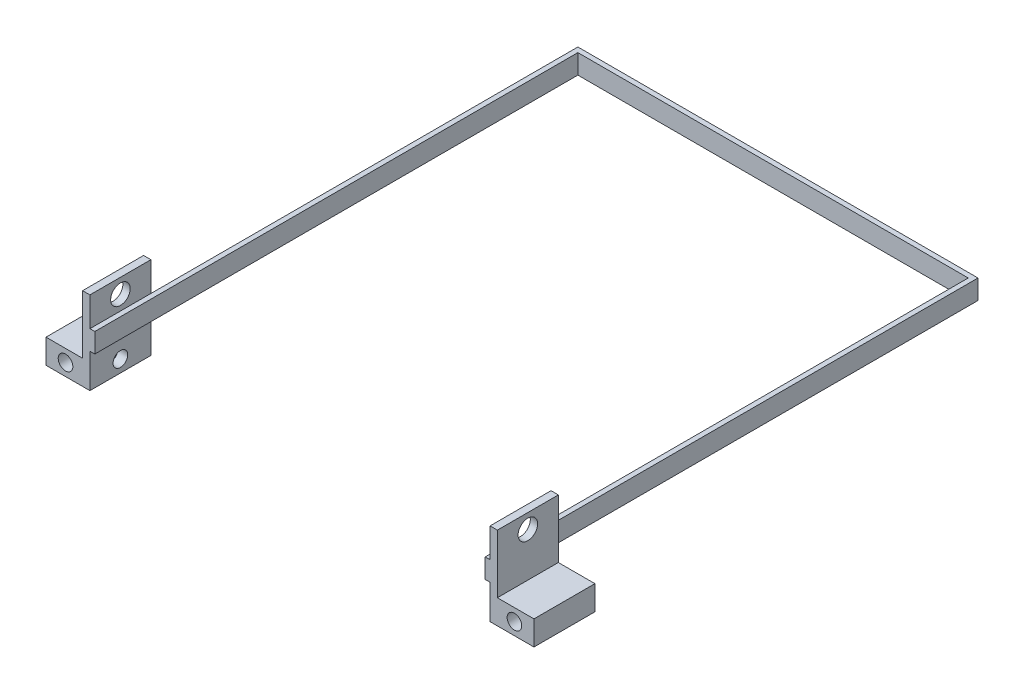
ISO-10303-21;
HEADER;
FILE_DESCRIPTION(('STEP AP214'),'2;1');
FILE_NAME('part.step','',(''),(''),'','','');
FILE_SCHEMA(('AUTOMOTIVE_DESIGN { 1 0 10303 214 1 1 1 1 }'));
ENDSEC;
DATA;
#1=APPLICATION_CONTEXT('core data for automotive mechanical design processes');
#2=APPLICATION_PROTOCOL_DEFINITION('international standard','automotive_design',2000,#1);
#3=PRODUCT_CONTEXT('',#1,'mechanical');
#4=PRODUCT('Part','Part','',(#3));
#5=PRODUCT_RELATED_PRODUCT_CATEGORY('part','',(#4));
#6=PRODUCT_DEFINITION_FORMATION('','',#4);
#7=PRODUCT_DEFINITION_CONTEXT('part definition',#1,'design');
#8=PRODUCT_DEFINITION('design','',#6,#7);
#9=PRODUCT_DEFINITION_SHAPE('','',#8);
#10=(LENGTH_UNIT() NAMED_UNIT(*) SI_UNIT(.MILLI.,.METRE.));
#11=(NAMED_UNIT(*) PLANE_ANGLE_UNIT() SI_UNIT($,.RADIAN.));
#12=(NAMED_UNIT(*) SI_UNIT($,.STERADIAN.) SOLID_ANGLE_UNIT());
#13=UNCERTAINTY_MEASURE_WITH_UNIT(LENGTH_MEASURE(1.E-05),#10,'distance_accuracy_value','');
#14=(GEOMETRIC_REPRESENTATION_CONTEXT(3) GLOBAL_UNCERTAINTY_ASSIGNED_CONTEXT((#13)) GLOBAL_UNIT_ASSIGNED_CONTEXT((#10,
#11,#12)) REPRESENTATION_CONTEXT('',''));
#15=CARTESIAN_POINT('',(0.,0.,0.));
#16=DIRECTION('',(0.,0.,1.));
#17=DIRECTION('',(1.,0.,0.));
#18=AXIS2_PLACEMENT_3D('',#15,#16,#17);
#19=CARTESIAN_POINT('',(150.362843907959,0.561265164644706,-199.999999999999));
#20=DIRECTION('',(-1.,0.,0.));
#21=DIRECTION('',(0.,1.,0.));
#22=AXIS2_PLACEMENT_3D('',#19,#20,#21);
#23=PLANE('',#22);
#24=DIRECTION('',(0.,1.,0.));
#25=VECTOR('',#24,1.);
#26=CARTESIAN_POINT('',(150.362843907958,12.5612651646447,-24.9999999999989));
#27=LINE('',#26,#25);
#28=CARTESIAN_POINT('',(150.362843907958,-7.43873483535529,-24.9999999999989));
#29=VERTEX_POINT('',#28);
#30=CARTESIAN_POINT('',(150.362843907958,0.561265164644706,-24.9999999999989));
#31=VERTEX_POINT('',#30);
#32=EDGE_CURVE('E11',#29,#31,#27,.T.);
#33=ORIENTED_EDGE('',*,*,#32,.F.);
#34=DIRECTION('',(0.,0.,1.));
#35=VECTOR('',#34,1.);
#36=CARTESIAN_POINT('',(150.362843907959,-7.43873483535529,-199.999999999999));
#37=LINE('',#36,#35);
#38=CARTESIAN_POINT('',(150.362843907959,-7.43873483535529,-199.999999999999));
#39=VERTEX_POINT('',#38);
#40=EDGE_CURVE('E44',#39,#29,#37,.T.);
#41=ORIENTED_EDGE('',*,*,#40,.F.);
#42=DIRECTION('',(0.,-1.,0.));
#43=VECTOR('',#42,1.);
#44=CARTESIAN_POINT('',(150.362843907959,0.561265164644706,-199.999999999999));
#45=LINE('',#44,#43);
#46=CARTESIAN_POINT('',(150.362843907959,0.561265164644706,-199.999999999999));
#47=VERTEX_POINT('',#46);
#48=EDGE_CURVE('E341',#47,#39,#45,.T.);
#49=ORIENTED_EDGE('',*,*,#48,.F.);
#50=DIRECTION('',(0.,0.,1.));
#51=VECTOR('',#50,1.);
#52=CARTESIAN_POINT('',(150.362843907959,0.561265164644706,-199.999999999999));
#53=LINE('',#52,#51);
#54=EDGE_CURVE('E358',#47,#31,#53,.T.);
#55=ORIENTED_EDGE('',*,*,#54,.T.);
#56=EDGE_LOOP('',(#33,#41,#49,#55));
#57=FACE_BOUND('',#56,.T.);
#58=ADVANCED_FACE('F41',(#57),#23,.F.);
#59=CARTESIAN_POINT('',(150.362843907959,-7.43873483535529,-199.999999999999));
#60=DIRECTION('',(0.,1.,0.));
#61=DIRECTION('',(0.,0.,-1.));
#62=AXIS2_PLACEMENT_3D('',#59,#60,#61);
#63=PLANE('',#62);
#64=DIRECTION('',(0.,0.,1.));
#65=VECTOR('',#64,1.);
#66=CARTESIAN_POINT('',(148.362843907959,-7.43873483535529,-197.999999999999));
#67=LINE('',#66,#65);
#68=CARTESIAN_POINT('',(148.362843907959,-7.43873483535529,-197.999999999999));
#69=VERTEX_POINT('',#68);
#70=CARTESIAN_POINT('',(148.362843907958,-7.43873483535529,1.03993149546166E-12));
#71=VERTEX_POINT('',#70);
#72=EDGE_CURVE('E338',#69,#71,#67,.T.);
#73=ORIENTED_EDGE('',*,*,#72,.F.);
#74=DIRECTION('',(-1.,0.,0.));
#75=VECTOR('',#74,1.);
#76=CARTESIAN_POINT('',(148.362843907959,-7.43873483535529,-197.999999999999));
#77=LINE('',#76,#75);
#78=CARTESIAN_POINT('',(-11.6371560920411,-7.43873483535529,-198.));
#79=VERTEX_POINT('',#78);
#80=EDGE_CURVE('E318',#69,#79,#77,.T.);
#81=ORIENTED_EDGE('',*,*,#80,.T.);
#82=DIRECTION('',(0.,0.,1.));
#83=VECTOR('',#82,1.);
#84=CARTESIAN_POINT('',(-11.6371560920411,-7.43873483535529,-198.));
#85=LINE('',#84,#83);
#86=CARTESIAN_POINT('',(-11.6371560920425,-7.43873483535529,0.));
#87=VERTEX_POINT('',#86);
#88=EDGE_CURVE('E335',#79,#87,#85,.T.);
#89=ORIENTED_EDGE('',*,*,#88,.T.);
#90=DIRECTION('',(-1.,0.,0.));
#91=VECTOR('',#90,1.);
#92=CARTESIAN_POINT('',(150.362843907958,-7.43873483535529,1.05389742081703E-12));
#93=LINE('',#92,#91);
#94=CARTESIAN_POINT('',(-13.6371560920423,-7.43873483535529,4.92661467177413E-13));
#95=VERTEX_POINT('',#94);
#96=EDGE_CURVE('E340',#87,#95,#93,.T.);
#97=ORIENTED_EDGE('',*,*,#96,.T.);
#98=DIRECTION('',(0.,0.,1.));
#99=VECTOR('',#98,1.);
#100=CARTESIAN_POINT('',(-13.6371560920411,-7.43873483535529,-200.));
#101=LINE('',#100,#99);
#102=CARTESIAN_POINT('',(-13.6371560920423,-7.43873483535529,-24.9999999999995));
#103=VERTEX_POINT('',#102);
#104=EDGE_CURVE('E363',#103,#95,#101,.T.);
#105=ORIENTED_EDGE('',*,*,#104,.F.);
#106=CARTESIAN_POINT('',(-13.6371560920411,-7.43873483535529,-200.));
#107=VERTEX_POINT('',#106);
#108=EDGE_CURVE('E364',#107,#103,#101,.T.);
#109=ORIENTED_EDGE('',*,*,#108,.F.);
#110=DIRECTION('',(-1.,0.,0.));
#111=VECTOR('',#110,1.);
#112=CARTESIAN_POINT('',(150.362843907959,-7.43873483535529,-199.999999999999));
#113=LINE('',#112,#111);
#114=EDGE_CURVE('E344',#39,#107,#113,.T.);
#115=ORIENTED_EDGE('',*,*,#114,.F.);
#116=ORIENTED_EDGE('',*,*,#40,.T.);
#117=CARTESIAN_POINT('',(150.362843907958,-7.43873483535529,1.05389742081703E-12));
#118=VERTEX_POINT('',#117);
#119=EDGE_CURVE('E366',#29,#118,#37,.T.);
#120=ORIENTED_EDGE('',*,*,#119,.T.);
#121=EDGE_CURVE('E352',#118,#71,#93,.T.);
#122=ORIENTED_EDGE('',*,*,#121,.T.);
#123=EDGE_LOOP('',(#73,#81,#89,#97,#105,#109,#115,#116,#120,#122));
#124=FACE_BOUND('',#123,.T.);
#125=ADVANCED_FACE('F385',(#124),#63,.F.);
#126=CARTESIAN_POINT('',(150.362843907959,0.561265164644706,-199.999999999999));
#127=DIRECTION('',(0.,-1.,0.));
#128=DIRECTION('',(0.,0.,1.));
#129=AXIS2_PLACEMENT_3D('',#126,#127,#128);
#130=PLANE('',#129);
#131=DIRECTION('',(0.,0.,1.));
#132=VECTOR('',#131,1.);
#133=CARTESIAN_POINT('',(148.362843907959,0.561265164644706,-197.999999999999));
#134=LINE('',#133,#132);
#135=CARTESIAN_POINT('',(148.362843907959,0.561265164644706,-197.999999999999));
#136=VERTEX_POINT('',#135);
#137=CARTESIAN_POINT('',(148.362843907958,0.561265164644706,1.03993149546166E-12));
#138=VERTEX_POINT('',#137);
#139=EDGE_CURVE('E327',#136,#138,#134,.T.);
#140=ORIENTED_EDGE('',*,*,#139,.T.);
#141=DIRECTION('',(1.,0.,0.));
#142=VECTOR('',#141,1.);
#143=CARTESIAN_POINT('',(150.362843907958,0.561265164644706,1.05389742081703E-12));
#144=LINE('',#143,#142);
#145=CARTESIAN_POINT('',(150.362843907958,0.561265164644706,1.05389742081703E-12));
#146=VERTEX_POINT('',#145);
#147=EDGE_CURVE('E355',#138,#146,#144,.T.);
#148=ORIENTED_EDGE('',*,*,#147,.T.);
#149=EDGE_CURVE('E351',#31,#146,#53,.T.);
#150=ORIENTED_EDGE('',*,*,#149,.F.);
#151=ORIENTED_EDGE('',*,*,#54,.F.);
#152=DIRECTION('',(1.,0.,0.));
#153=VECTOR('',#152,1.);
#154=CARTESIAN_POINT('',(150.362843907959,0.561265164644706,-199.999999999999));
#155=LINE('',#154,#153);
#156=CARTESIAN_POINT('',(-13.6371560920411,0.561265164644706,-200.));
#157=VERTEX_POINT('',#156);
#158=EDGE_CURVE('E349',#157,#47,#155,.T.);
#159=ORIENTED_EDGE('',*,*,#158,.F.);
#160=DIRECTION('',(0.,0.,1.));
#161=VECTOR('',#160,1.);
#162=CARTESIAN_POINT('',(-13.6371560920411,0.561265164644706,-200.));
#163=LINE('',#162,#161);
#164=CARTESIAN_POINT('',(-13.6371560920423,0.561265164644706,-24.9999999999995));
#165=VERTEX_POINT('',#164);
#166=EDGE_CURVE('E361',#157,#165,#163,.T.);
#167=ORIENTED_EDGE('',*,*,#166,.T.);
#168=CARTESIAN_POINT('',(-13.6371560920423,0.561265164644706,4.92661467177413E-13));
#169=VERTEX_POINT('',#168);
#170=EDGE_CURVE('E360',#165,#169,#163,.T.);
#171=ORIENTED_EDGE('',*,*,#170,.T.);
#172=CARTESIAN_POINT('',(-11.6371560920425,0.561265164644706,0.));
#173=VERTEX_POINT('',#172);
#174=EDGE_CURVE('E345',#169,#173,#144,.T.);
#175=ORIENTED_EDGE('',*,*,#174,.T.);
#176=DIRECTION('',(0.,0.,1.));
#177=VECTOR('',#176,1.);
#178=CARTESIAN_POINT('',(-11.6371560920411,0.561265164644803,-198.));
#179=LINE('',#178,#177);
#180=CARTESIAN_POINT('',(-11.6371560920411,0.561265164644803,-198.));
#181=VERTEX_POINT('',#180);
#182=EDGE_CURVE('E333',#181,#173,#179,.T.);
#183=ORIENTED_EDGE('',*,*,#182,.F.);
#184=DIRECTION('',(1.,0.,0.));
#185=VECTOR('',#184,1.);
#186=CARTESIAN_POINT('',(148.362843907959,0.561265164644706,-197.999999999999));
#187=LINE('',#186,#185);
#188=EDGE_CURVE('E324',#181,#136,#187,.T.);
#189=ORIENTED_EDGE('',*,*,#188,.T.);
#190=EDGE_LOOP('',(#140,#148,#150,#151,#159,#167,#171,#175,#183,#189));
#191=FACE_BOUND('',#190,.T.);
#192=ADVANCED_FACE('F395',(#191),#130,.F.);
#193=CARTESIAN_POINT('',(150.362843907958,0.561265164644706,1.05389742081703E-12));
#194=DIRECTION('',(0.,0.,-1.));
#195=DIRECTION('',(-1.,0.,0.));
#196=AXIS2_PLACEMENT_3D('',#193,#194,#195);
#197=PLANE('',#196);
#198=DIRECTION('',(0.,-1.,0.));
#199=VECTOR('',#198,1.);
#200=CARTESIAN_POINT('',(148.362843907958,0.561265164644706,1.03993149546166E-12));
#201=LINE('',#200,#199);
#202=EDGE_CURVE('E312',#138,#71,#201,.T.);
#203=ORIENTED_EDGE('',*,*,#202,.T.);
#204=ORIENTED_EDGE('',*,*,#121,.F.);
#205=DIRECTION('',(0.,1.,0.));
#206=VECTOR('',#205,1.);
#207=CARTESIAN_POINT('',(150.362843907958,12.5612651646447,1.0547118733939E-12));
#208=LINE('',#207,#206);
#209=CARTESIAN_POINT('',(150.362843907958,-21.4387348353553,1.0547118733939E-12));
#210=VERTEX_POINT('',#209);
#211=EDGE_CURVE('E229',#210,#118,#208,.T.);
#212=ORIENTED_EDGE('',*,*,#211,.F.);
#213=DIRECTION('',(-1.,0.,0.));
#214=VECTOR('',#213,1.);
#215=CARTESIAN_POINT('',(168.362843907958,-21.4387348353553,1.17961196366423E-12));
#216=LINE('',#215,#214);
#217=CARTESIAN_POINT('',(168.362843907958,-21.4387348353553,1.17961196366423E-12));
#218=VERTEX_POINT('',#217);
#219=EDGE_CURVE('E217',#218,#210,#216,.T.);
#220=ORIENTED_EDGE('',*,*,#219,.F.);
#221=DIRECTION('',(0.,-1.,0.));
#222=VECTOR('',#221,1.);
#223=CARTESIAN_POINT('',(168.362843907958,12.5612651646447,1.17961196366423E-12));
#224=LINE('',#223,#222);
#225=CARTESIAN_POINT('',(168.362843907958,-11.4387348353553,1.17961196366423E-12));
#226=VERTEX_POINT('',#225);
#227=EDGE_CURVE('E209',#226,#218,#224,.T.);
#228=ORIENTED_EDGE('',*,*,#227,.F.);
#229=DIRECTION('',(-1.,0.,0.));
#230=VECTOR('',#229,1.);
#231=CARTESIAN_POINT('',(168.362843907958,-11.4387348353553,1.17961196366423E-12));
#232=LINE('',#231,#230);
#233=CARTESIAN_POINT('',(153.362843907958,-11.4387348353553,1.07552855510562E-12));
#234=VERTEX_POINT('',#233);
#235=EDGE_CURVE('E192',#226,#234,#232,.T.);
#236=ORIENTED_EDGE('',*,*,#235,.T.);
#237=DIRECTION('',(0.,1.,0.));
#238=VECTOR('',#237,1.);
#239=CARTESIAN_POINT('',(153.362843907958,12.5612651646447,1.07552855510562E-12));
#240=LINE('',#239,#238);
#241=CARTESIAN_POINT('',(153.362843907958,12.5612651646447,1.07552855510562E-12));
#242=VERTEX_POINT('',#241);
#243=EDGE_CURVE('E202',#234,#242,#240,.T.);
#244=ORIENTED_EDGE('',*,*,#243,.T.);
#245=DIRECTION('',(1.,0.,0.));
#246=VECTOR('',#245,1.);
#247=CARTESIAN_POINT('',(168.362843907958,12.5612651646447,1.17961196366423E-12));
#248=LINE('',#247,#246);
#249=CARTESIAN_POINT('',(150.362843907958,12.5612651646447,1.0547118733939E-12));
#250=VERTEX_POINT('',#249);
#251=EDGE_CURVE('E232',#250,#242,#248,.T.);
#252=ORIENTED_EDGE('',*,*,#251,.F.);
#253=EDGE_CURVE('E221',#146,#250,#208,.T.);
#254=ORIENTED_EDGE('',*,*,#253,.F.);
#255=ORIENTED_EDGE('',*,*,#147,.F.);
#256=EDGE_LOOP('',(#203,#204,#212,#220,#228,#236,#244,#252,#254,#255));
#257=FACE_BOUND('',#256,.T.);
#258=CARTESIAN_POINT('',(160.362843907958,-16.4387348353553,1.12410081243297E-12));
#259=DIRECTION('',(0.,0.,-1.));
#260=DIRECTION('',(-1.,0.,0.));
#261=AXIS2_PLACEMENT_3D('',#258,#259,#260);
#262=CIRCLE('',#261,3.);
#263=CARTESIAN_POINT('',(157.362843907958,-16.4387348353553,1.10315192439991E-12));
#264=VERTEX_POINT('',#263);
#265=EDGE_CURVE('E219',#264,#264,#262,.T.);
#266=ORIENTED_EDGE('',*,*,#265,.T.);
#267=EDGE_LOOP('',(#266));
#268=FACE_BOUND('',#267,.T.);
#269=ADVANCED_FACE('F214',(#257,#268),#197,.F.);
#270=DIRECTION('',(0.,1.,0.));
#271=VECTOR('',#270,1.);
#272=CARTESIAN_POINT('',(-11.6371560920425,0.561265164644803,0.));
#273=LINE('',#272,#271);
#274=EDGE_CURVE('E319',#87,#173,#273,.T.);
#275=ORIENTED_EDGE('',*,*,#274,.T.);
#276=ORIENTED_EDGE('',*,*,#174,.F.);
#277=DIRECTION('',(0.,1.,0.));
#278=VECTOR('',#277,1.);
#279=CARTESIAN_POINT('',(-13.6371560920423,12.5612651646446,4.92661467177413E-13));
#280=LINE('',#279,#278);
#281=CARTESIAN_POINT('',(-13.6371560920423,12.5612651646446,4.92661467177413E-13));
#282=VERTEX_POINT('',#281);
#283=EDGE_CURVE('E288',#169,#282,#280,.T.);
#284=ORIENTED_EDGE('',*,*,#283,.T.);
#285=DIRECTION('',(-1.,0.,0.));
#286=VECTOR('',#285,1.);
#287=CARTESIAN_POINT('',(-31.6371560920423,12.5612651646446,4.92661467177413E-13));
#288=LINE('',#287,#286);
#289=CARTESIAN_POINT('',(-16.6371560920423,12.5612651646446,4.92661467177413E-13));
#290=VERTEX_POINT('',#289);
#291=EDGE_CURVE('E292',#282,#290,#288,.T.);
#292=ORIENTED_EDGE('',*,*,#291,.T.);
#293=DIRECTION('',(0.,1.,0.));
#294=VECTOR('',#293,1.);
#295=CARTESIAN_POINT('',(-16.6371560920423,12.5612651646446,4.92661467177413E-13));
#296=LINE('',#295,#294);
#297=CARTESIAN_POINT('',(-16.6371560920423,-11.4387348353554,4.92661467177413E-13));
#298=VERTEX_POINT('',#297);
#299=EDGE_CURVE('E271',#298,#290,#296,.T.);
#300=ORIENTED_EDGE('',*,*,#299,.F.);
#301=DIRECTION('',(1.,0.,0.));
#302=VECTOR('',#301,1.);
#303=CARTESIAN_POINT('',(-31.6371560920423,-11.4387348353554,4.92661467177413E-13));
#304=LINE('',#303,#302);
#305=CARTESIAN_POINT('',(-31.6371560920423,-11.4387348353554,4.92661467177413E-13));
#306=VERTEX_POINT('',#305);
#307=EDGE_CURVE('E255',#306,#298,#304,.T.);
#308=ORIENTED_EDGE('',*,*,#307,.F.);
#309=DIRECTION('',(0.,-1.,0.));
#310=VECTOR('',#309,1.);
#311=CARTESIAN_POINT('',(-31.6371560920423,12.5612651646446,4.92661467177413E-13));
#312=LINE('',#311,#310);
#313=CARTESIAN_POINT('',(-31.6371560920422,-21.4387348353554,4.92661467177413E-13));
#314=VERTEX_POINT('',#313);
#315=EDGE_CURVE('E283',#306,#314,#312,.T.);
#316=ORIENTED_EDGE('',*,*,#315,.T.);
#317=DIRECTION('',(1.,0.,0.));
#318=VECTOR('',#317,1.);
#319=CARTESIAN_POINT('',(-31.6371560920422,-21.4387348353554,4.92661467177413E-13));
#320=LINE('',#319,#318);
#321=CARTESIAN_POINT('',(-13.6371560920422,-21.4387348353554,4.92661467177413E-13));
#322=VERTEX_POINT('',#321);
#323=EDGE_CURVE('E285',#314,#322,#320,.T.);
#324=ORIENTED_EDGE('',*,*,#323,.T.);
#325=EDGE_CURVE('E289',#322,#95,#280,.T.);
#326=ORIENTED_EDGE('',*,*,#325,.T.);
#327=ORIENTED_EDGE('',*,*,#96,.F.);
#328=EDGE_LOOP('',(#275,#276,#284,#292,#300,#308,#316,#324,#326,#327));
#329=FACE_BOUND('',#328,.T.);
#330=CARTESIAN_POINT('',(-23.6371560920423,-16.4387348353554,4.92661467177413E-13));
#331=DIRECTION('',(0.,0.,1.));
#332=DIRECTION('',(1.,0.,0.));
#333=AXIS2_PLACEMENT_3D('',#330,#331,#332);
#334=CIRCLE('',#333,3.);
#335=CARTESIAN_POINT('',(-20.6371560920423,-16.4387348353554,4.92661467177413E-13));
#336=VERTEX_POINT('',#335);
#337=EDGE_CURVE('E263',#336,#336,#334,.T.);
#338=ORIENTED_EDGE('',*,*,#337,.F.);
#339=EDGE_LOOP('',(#338));
#340=FACE_BOUND('',#339,.T.);
#341=ADVANCED_FACE('F380',(#329,#340),#197,.F.);
#342=CARTESIAN_POINT('',(-13.6371560920411,0.561265164644706,-200.));
#343=DIRECTION('',(1.,0.,0.));
#344=DIRECTION('',(0.,0.,-1.));
#345=AXIS2_PLACEMENT_3D('',#342,#343,#344);
#346=PLANE('',#345);
#347=ORIENTED_EDGE('',*,*,#108,.T.);
#348=DIRECTION('',(0.,1.,0.));
#349=VECTOR('',#348,1.);
#350=CARTESIAN_POINT('',(-13.6371560920423,12.5612651646446,-24.9999999999995));
#351=LINE('',#350,#349);
#352=EDGE_CURVE('E49',#103,#165,#351,.T.);
#353=ORIENTED_EDGE('',*,*,#352,.T.);
#354=ORIENTED_EDGE('',*,*,#166,.F.);
#355=DIRECTION('',(0.,1.,0.));
#356=VECTOR('',#355,1.);
#357=CARTESIAN_POINT('',(-13.6371560920411,0.561265164644706,-200.));
#358=LINE('',#357,#356);
#359=EDGE_CURVE('E347',#107,#157,#358,.T.);
#360=ORIENTED_EDGE('',*,*,#359,.F.);
#361=EDGE_LOOP('',(#347,#353,#354,#360));
#362=FACE_BOUND('',#361,.T.);
#363=ADVANCED_FACE('F490',(#362),#346,.F.);
#364=CARTESIAN_POINT('',(150.362843907959,0.561265164644706,-199.999999999999));
#365=DIRECTION('',(0.,0.,-1.));
#366=DIRECTION('',(-1.,0.,0.));
#367=AXIS2_PLACEMENT_3D('',#364,#365,#366);
#368=PLANE('',#367);
#369=ORIENTED_EDGE('',*,*,#48,.T.);
#370=ORIENTED_EDGE('',*,*,#114,.T.);
#371=ORIENTED_EDGE('',*,*,#359,.T.);
#372=ORIENTED_EDGE('',*,*,#158,.T.);
#373=EDGE_LOOP('',(#369,#370,#371,#372));
#374=FACE_BOUND('',#373,.T.);
#375=ADVANCED_FACE('F483',(#374),#368,.T.);
#376=CARTESIAN_POINT('',(148.362843907959,0.561265164644706,-197.999999999999));
#377=DIRECTION('',(-1.,0.,0.));
#378=DIRECTION('',(0.,1.,0.));
#379=AXIS2_PLACEMENT_3D('',#376,#377,#378);
#380=PLANE('',#379);
#381=ORIENTED_EDGE('',*,*,#202,.F.);
#382=ORIENTED_EDGE('',*,*,#139,.F.);
#383=DIRECTION('',(0.,-1.,0.));
#384=VECTOR('',#383,1.);
#385=CARTESIAN_POINT('',(148.362843907959,0.561265164644706,-197.999999999999));
#386=LINE('',#385,#384);
#387=EDGE_CURVE('E315',#136,#69,#386,.T.);
#388=ORIENTED_EDGE('',*,*,#387,.T.);
#389=ORIENTED_EDGE('',*,*,#72,.T.);
#390=EDGE_LOOP('',(#381,#382,#388,#389));
#391=FACE_BOUND('',#390,.T.);
#392=ADVANCED_FACE('F481',(#391),#380,.T.);
#393=CARTESIAN_POINT('',(-11.6371560920411,0.561265164644803,-198.));
#394=DIRECTION('',(1.,0.,0.));
#395=DIRECTION('',(0.,0.,-1.));
#396=AXIS2_PLACEMENT_3D('',#393,#394,#395);
#397=PLANE('',#396);
#398=ORIENTED_EDGE('',*,*,#274,.F.);
#399=ORIENTED_EDGE('',*,*,#88,.F.);
#400=DIRECTION('',(0.,1.,0.));
#401=VECTOR('',#400,1.);
#402=CARTESIAN_POINT('',(-11.6371560920411,0.561265164644803,-198.));
#403=LINE('',#402,#401);
#404=EDGE_CURVE('E322',#79,#181,#403,.T.);
#405=ORIENTED_EDGE('',*,*,#404,.T.);
#406=ORIENTED_EDGE('',*,*,#182,.T.);
#407=EDGE_LOOP('',(#398,#399,#405,#406));
#408=FACE_BOUND('',#407,.T.);
#409=ADVANCED_FACE('F388',(#408),#397,.T.);
#410=CARTESIAN_POINT('',(150.362843907959,0.561265164644706,-197.999999999999));
#411=DIRECTION('',(0.,0.,-1.));
#412=DIRECTION('',(-1.,0.,0.));
#413=AXIS2_PLACEMENT_3D('',#410,#411,#412);
#414=PLANE('',#413);
#415=ORIENTED_EDGE('',*,*,#387,.F.);
#416=ORIENTED_EDGE('',*,*,#188,.F.);
#417=ORIENTED_EDGE('',*,*,#404,.F.);
#418=ORIENTED_EDGE('',*,*,#80,.F.);
#419=EDGE_LOOP('',(#415,#416,#417,#418));
#420=FACE_BOUND('',#419,.T.);
#421=ADVANCED_FACE('F392',(#420),#414,.F.);
#422=CARTESIAN_POINT('',(-13.6371560920423,12.5612651646446,4.92661467177413E-13));
#423=DIRECTION('',(-1.,0.,0.));
#424=DIRECTION('',(0.,-1.,0.));
#425=AXIS2_PLACEMENT_3D('',#422,#423,#424);
#426=PLANE('',#425);
#427=CARTESIAN_POINT('',(-13.6371560920422,-16.4387348353554,-12.4999999999995));
#428=DIRECTION('',(1.,0.,0.));
#429=DIRECTION('',(0.,1.,0.));
#430=AXIS2_PLACEMENT_3D('',#427,#428,#429);
#431=CIRCLE('',#430,3.);
#432=CARTESIAN_POINT('',(-13.6371560920422,-13.4387348353554,-12.4999999999995));
#433=VERTEX_POINT('',#432);
#434=EDGE_CURVE('E256',#433,#433,#431,.T.);
#435=ORIENTED_EDGE('',*,*,#434,.F.);
#436=EDGE_LOOP('',(#435));
#437=FACE_BOUND('',#436,.T.);
#438=CARTESIAN_POINT('',(-13.6371560920422,-21.4387348353554,-24.9999999999995));
#439=VERTEX_POINT('',#438);
#440=EDGE_CURVE('E299',#439,#103,#351,.T.);
#441=ORIENTED_EDGE('',*,*,#440,.T.);
#442=ORIENTED_EDGE('',*,*,#104,.T.);
#443=ORIENTED_EDGE('',*,*,#325,.F.);
#444=DIRECTION('',(0.,0.,-1.));
#445=VECTOR('',#444,1.);
#446=CARTESIAN_POINT('',(-13.6371560920422,-21.4387348353554,4.92661467177413E-13));
#447=LINE('',#446,#445);
#448=EDGE_CURVE('E306',#322,#439,#447,.T.);
#449=ORIENTED_EDGE('',*,*,#448,.T.);
#450=EDGE_LOOP('',(#441,#442,#443,#449));
#451=FACE_BOUND('',#450,.T.);
#452=ADVANCED_FACE('F374',(#437,#451),#426,.F.);
#453=CARTESIAN_POINT('',(-31.6371560920423,12.5612651646446,4.92661467177413E-13));
#454=DIRECTION('',(1.,0.,0.));
#455=DIRECTION('',(0.,1.,0.));
#456=AXIS2_PLACEMENT_3D('',#453,#454,#455);
#457=PLANE('',#456);
#458=ORIENTED_EDGE('',*,*,#315,.F.);
#459=DIRECTION('',(0.,0.,1.));
#460=VECTOR('',#459,1.);
#461=CARTESIAN_POINT('',(-31.6371560920423,-11.4387348353554,-24.9999999999995));
#462=LINE('',#461,#460);
#463=CARTESIAN_POINT('',(-31.6371560920423,-11.4387348353554,-24.9999999999995));
#464=VERTEX_POINT('',#463);
#465=EDGE_CURVE('E274',#464,#306,#462,.T.);
#466=ORIENTED_EDGE('',*,*,#465,.F.);
#467=DIRECTION('',(0.,-1.,0.));
#468=VECTOR('',#467,1.);
#469=CARTESIAN_POINT('',(-31.6371560920423,12.5612651646446,-24.9999999999995));
#470=LINE('',#469,#468);
#471=CARTESIAN_POINT('',(-31.6371560920422,-21.4387348353554,-24.9999999999995));
#472=VERTEX_POINT('',#471);
#473=EDGE_CURVE('E262',#464,#472,#470,.T.);
#474=ORIENTED_EDGE('',*,*,#473,.T.);
#475=DIRECTION('',(0.,0.,-1.));
#476=VECTOR('',#475,1.);
#477=CARTESIAN_POINT('',(-31.6371560920422,-21.4387348353554,4.92661467177413E-13));
#478=LINE('',#477,#476);
#479=EDGE_CURVE('E309',#314,#472,#478,.T.);
#480=ORIENTED_EDGE('',*,*,#479,.F.);
#481=EDGE_LOOP('',(#458,#466,#474,#480));
#482=FACE_BOUND('',#481,.T.);
#483=ADVANCED_FACE('F418',(#482),#457,.F.);
#484=CARTESIAN_POINT('',(-31.6371560920422,-21.4387348353554,4.92661467177413E-13));
#485=DIRECTION('',(0.,1.,0.));
#486=DIRECTION('',(0.,0.,1.));
#487=AXIS2_PLACEMENT_3D('',#484,#485,#486);
#488=PLANE('',#487);
#489=DIRECTION('',(1.,0.,0.));
#490=VECTOR('',#489,1.);
#491=CARTESIAN_POINT('',(-31.6371560920422,-21.4387348353554,-24.9999999999995));
#492=LINE('',#491,#490);
#493=EDGE_CURVE('E297',#472,#439,#492,.T.);
#494=ORIENTED_EDGE('',*,*,#493,.T.);
#495=ORIENTED_EDGE('',*,*,#448,.F.);
#496=ORIENTED_EDGE('',*,*,#323,.F.);
#497=ORIENTED_EDGE('',*,*,#479,.T.);
#498=EDGE_LOOP('',(#494,#495,#496,#497));
#499=FACE_BOUND('',#498,.T.);
#500=ADVANCED_FACE('F421',(#499),#488,.F.);
#501=ORIENTED_EDGE('',*,*,#170,.F.);
#502=CARTESIAN_POINT('',(-13.6371560920423,12.5612651646446,-24.9999999999995));
#503=VERTEX_POINT('',#502);
#504=EDGE_CURVE('E65',#165,#503,#351,.T.);
#505=ORIENTED_EDGE('',*,*,#504,.T.);
#506=DIRECTION('',(0.,0.,-1.));
#507=VECTOR('',#506,1.);
#508=CARTESIAN_POINT('',(-13.6371560920423,12.5612651646446,4.92661467177413E-13));
#509=LINE('',#508,#507);
#510=EDGE_CURVE('E295',#282,#503,#509,.T.);
#511=ORIENTED_EDGE('',*,*,#510,.F.);
#512=ORIENTED_EDGE('',*,*,#283,.F.);
#513=EDGE_LOOP('',(#501,#505,#511,#512));
#514=FACE_BOUND('',#513,.T.);
#515=CARTESIAN_POINT('',(-13.6371560920423,6.5612651646446,-12.4999999999995));
#516=DIRECTION('',(1.,0.,0.));
#517=DIRECTION('',(0.,1.,0.));
#518=AXIS2_PLACEMENT_3D('',#515,#516,#517);
#519=CIRCLE('',#518,4.);
#520=CARTESIAN_POINT('',(-13.6371560920423,10.5612651646446,-12.4999999999995));
#521=VERTEX_POINT('',#520);
#522=EDGE_CURVE('E243',#521,#521,#519,.T.);
#523=ORIENTED_EDGE('',*,*,#522,.F.);
#524=EDGE_LOOP('',(#523));
#525=FACE_BOUND('',#524,.T.);
#526=ADVANCED_FACE('F402',(#514,#525),#426,.F.);
#527=CARTESIAN_POINT('',(-31.6371560920423,12.5612651646446,4.92661467177413E-13));
#528=DIRECTION('',(0.,-1.,0.));
#529=DIRECTION('',(0.,0.,-1.));
#530=AXIS2_PLACEMENT_3D('',#527,#528,#529);
#531=PLANE('',#530);
#532=DIRECTION('',(-1.,0.,0.));
#533=VECTOR('',#532,1.);
#534=CARTESIAN_POINT('',(-31.6371560920423,12.5612651646446,-24.9999999999995));
#535=LINE('',#534,#533);
#536=CARTESIAN_POINT('',(-16.6371560920423,12.5612651646446,-24.9999999999995));
#537=VERTEX_POINT('',#536);
#538=EDGE_CURVE('E286',#503,#537,#535,.T.);
#539=ORIENTED_EDGE('',*,*,#538,.T.);
#540=DIRECTION('',(0.,0.,1.));
#541=VECTOR('',#540,1.);
#542=CARTESIAN_POINT('',(-16.6371560920423,12.5612651646446,-24.9999999999995));
#543=LINE('',#542,#541);
#544=EDGE_CURVE('E266',#537,#290,#543,.T.);
#545=ORIENTED_EDGE('',*,*,#544,.T.);
#546=ORIENTED_EDGE('',*,*,#291,.F.);
#547=ORIENTED_EDGE('',*,*,#510,.T.);
#548=EDGE_LOOP('',(#539,#545,#546,#547));
#549=FACE_BOUND('',#548,.T.);
#550=ADVANCED_FACE('F405',(#549),#531,.F.);
#551=CARTESIAN_POINT('',(-31.6371560920423,12.5612651646446,-24.9999999999995));
#552=DIRECTION('',(0.,0.,1.));
#553=DIRECTION('',(1.,0.,0.));
#554=AXIS2_PLACEMENT_3D('',#551,#552,#553);
#555=PLANE('',#554);
#556=CARTESIAN_POINT('',(-23.6371560920423,-16.4387348353554,-24.9999999999995));
#557=DIRECTION('',(0.,0.,1.));
#558=DIRECTION('',(1.,0.,0.));
#559=AXIS2_PLACEMENT_3D('',#556,#557,#558);
#560=CIRCLE('',#559,3.);
#561=CARTESIAN_POINT('',(-20.6371560920423,-16.4387348353554,-24.9999999999995));
#562=VERTEX_POINT('',#561);
#563=EDGE_CURVE('E259',#562,#562,#560,.T.);
#564=ORIENTED_EDGE('',*,*,#563,.T.);
#565=EDGE_LOOP('',(#564));
#566=FACE_BOUND('',#565,.T.);
#567=DIRECTION('',(1.,0.,0.));
#568=VECTOR('',#567,1.);
#569=CARTESIAN_POINT('',(-31.6371560920423,-11.4387348353554,-24.9999999999995));
#570=LINE('',#569,#568);
#571=CARTESIAN_POINT('',(-16.6371560920423,-11.4387348353554,-24.9999999999995));
#572=VERTEX_POINT('',#571);
#573=EDGE_CURVE('E267',#464,#572,#570,.T.);
#574=ORIENTED_EDGE('',*,*,#573,.T.);
#575=DIRECTION('',(0.,1.,0.));
#576=VECTOR('',#575,1.);
#577=CARTESIAN_POINT('',(-16.6371560920423,12.5612651646446,-24.9999999999995));
#578=LINE('',#577,#576);
#579=EDGE_CURVE('E270',#572,#537,#578,.T.);
#580=ORIENTED_EDGE('',*,*,#579,.T.);
#581=ORIENTED_EDGE('',*,*,#538,.F.);
#582=ORIENTED_EDGE('',*,*,#504,.F.);
#583=ORIENTED_EDGE('',*,*,#352,.F.);
#584=ORIENTED_EDGE('',*,*,#440,.F.);
#585=ORIENTED_EDGE('',*,*,#493,.F.);
#586=ORIENTED_EDGE('',*,*,#473,.F.);
#587=EDGE_LOOP('',(#574,#580,#581,#582,#583,#584,#585,#586));
#588=FACE_BOUND('',#587,.T.);
#589=ADVANCED_FACE('F409',(#566,#588),#555,.F.);
#590=CARTESIAN_POINT('',(-16.6371560920423,12.5612651646446,-24.9999999999995));
#591=DIRECTION('',(1.,0.,0.));
#592=DIRECTION('',(0.,1.,0.));
#593=AXIS2_PLACEMENT_3D('',#590,#591,#592);
#594=PLANE('',#593);
#595=CARTESIAN_POINT('',(-16.6371560920423,6.5612651646446,-12.4999999999995));
#596=DIRECTION('',(1.,0.,0.));
#597=DIRECTION('',(0.,1.,0.));
#598=AXIS2_PLACEMENT_3D('',#595,#596,#597);
#599=CIRCLE('',#598,4.);
#600=CARTESIAN_POINT('',(-16.6371560920423,10.5612651646446,-12.4999999999995));
#601=VERTEX_POINT('',#600);
#602=EDGE_CURVE('E251',#601,#601,#599,.T.);
#603=ORIENTED_EDGE('',*,*,#602,.T.);
#604=EDGE_LOOP('',(#603));
#605=FACE_BOUND('',#604,.T.);
#606=ORIENTED_EDGE('',*,*,#299,.T.);
#607=ORIENTED_EDGE('',*,*,#544,.F.);
#608=ORIENTED_EDGE('',*,*,#579,.F.);
#609=DIRECTION('',(0.,0.,1.));
#610=VECTOR('',#609,1.);
#611=CARTESIAN_POINT('',(-16.6371560920423,-11.4387348353554,-24.9999999999995));
#612=LINE('',#611,#610);
#613=EDGE_CURVE('E280',#572,#298,#612,.T.);
#614=ORIENTED_EDGE('',*,*,#613,.T.);
#615=EDGE_LOOP('',(#606,#607,#608,#614));
#616=FACE_BOUND('',#615,.T.);
#617=ADVANCED_FACE('F407',(#605,#616),#594,.F.);
#618=CARTESIAN_POINT('',(-31.6371560920423,-11.4387348353554,-24.9999999999995));
#619=DIRECTION('',(0.,-1.,0.));
#620=DIRECTION('',(0.,0.,-1.));
#621=AXIS2_PLACEMENT_3D('',#618,#619,#620);
#622=PLANE('',#621);
#623=ORIENTED_EDGE('',*,*,#307,.T.);
#624=ORIENTED_EDGE('',*,*,#613,.F.);
#625=ORIENTED_EDGE('',*,*,#573,.F.);
#626=ORIENTED_EDGE('',*,*,#465,.T.);
#627=EDGE_LOOP('',(#623,#624,#625,#626));
#628=FACE_BOUND('',#627,.T.);
#629=ADVANCED_FACE('F414',(#628),#622,.F.);
#630=CARTESIAN_POINT('',(-23.6371560920423,-16.4387348353554,-24.9999999999995));
#631=DIRECTION('',(0.,0.,1.));
#632=DIRECTION('',(1.,0.,0.));
#633=AXIS2_PLACEMENT_3D('',#630,#631,#632);
#634=CYLINDRICAL_SURFACE('',#633,3.);
#635=ORIENTED_EDGE('',*,*,#563,.F.);
#636=EDGE_LOOP('',(#635));
#637=FACE_BOUND('',#636,.T.);
#638=ORIENTED_EDGE('',*,*,#337,.T.);
#639=EDGE_LOOP('',(#638));
#640=FACE_BOUND('',#639,.T.);
#641=ADVANCED_FACE('F589',(#637,#640),#634,.F.);
#642=CARTESIAN_POINT('',(-17.6371560920423,-16.4387348353554,-12.4999999999995));
#643=DIRECTION('',(1.,0.,0.));
#644=DIRECTION('',(0.,1.,0.));
#645=AXIS2_PLACEMENT_3D('',#642,#643,#644);
#646=CYLINDRICAL_SURFACE('',#645,3.);
#647=CARTESIAN_POINT('',(-17.6371560920423,-16.4387348353554,-12.4999999999995));
#648=DIRECTION('',(1.,0.,0.));
#649=DIRECTION('',(0.,1.,0.));
#650=AXIS2_PLACEMENT_3D('',#647,#648,#649);
#651=CIRCLE('',#650,3.);
#652=CARTESIAN_POINT('',(-17.6371560920423,-13.4387348353554,-12.4999999999995));
#653=VERTEX_POINT('',#652);
#654=EDGE_CURVE('E252',#653,#653,#651,.T.);
#655=ORIENTED_EDGE('',*,*,#654,.F.);
#656=EDGE_LOOP('',(#655));
#657=FACE_BOUND('',#656,.T.);
#658=ORIENTED_EDGE('',*,*,#434,.T.);
#659=EDGE_LOOP('',(#658));
#660=FACE_BOUND('',#659,.T.);
#661=ADVANCED_FACE('F597',(#657,#660),#646,.F.);
#662=CARTESIAN_POINT('',(-17.6371560920423,-16.4387348353554,-12.4999999999995));
#663=DIRECTION('',(1.,0.,0.));
#664=DIRECTION('',(0.,1.,0.));
#665=AXIS2_PLACEMENT_3D('',#662,#663,#664);
#666=PLANE('',#665);
#667=ORIENTED_EDGE('',*,*,#654,.T.);
#668=EDGE_LOOP('',(#667));
#669=FACE_BOUND('',#668,.T.);
#670=ADVANCED_FACE('F606',(#669),#666,.T.);
#671=CARTESIAN_POINT('',(-31.6371560920423,6.56126516464459,-12.4999999999995));
#672=DIRECTION('',(1.,0.,0.));
#673=DIRECTION('',(0.,1.,0.));
#674=AXIS2_PLACEMENT_3D('',#671,#672,#673);
#675=CYLINDRICAL_SURFACE('',#674,4.);
#676=ORIENTED_EDGE('',*,*,#522,.T.);
#677=EDGE_LOOP('',(#676));
#678=FACE_BOUND('',#677,.T.);
#679=ORIENTED_EDGE('',*,*,#602,.F.);
#680=EDGE_LOOP('',(#679));
#681=FACE_BOUND('',#680,.T.);
#682=ADVANCED_FACE('F465',(#678,#681),#675,.F.);
#683=CARTESIAN_POINT('',(150.362843907958,12.5612651646447,-24.9999999999989));
#684=DIRECTION('',(1.,0.,0.));
#685=DIRECTION('',(0.,-1.,0.));
#686=AXIS2_PLACEMENT_3D('',#683,#684,#685);
#687=PLANE('',#686);
#688=CARTESIAN_POINT('',(150.362843907958,6.56126516464468,-12.499999999999));
#689=DIRECTION('',(-1.,0.,0.));
#690=DIRECTION('',(0.,1.,0.));
#691=AXIS2_PLACEMENT_3D('',#688,#689,#690);
#692=CIRCLE('',#691,4.);
#693=CARTESIAN_POINT('',(150.362843907958,10.5612651646447,-12.499999999999));
#694=VERTEX_POINT('',#693);
#695=EDGE_CURVE('E248',#694,#694,#692,.T.);
#696=ORIENTED_EDGE('',*,*,#695,.F.);
#697=EDGE_LOOP('',(#696));
#698=FACE_BOUND('',#697,.T.);
#699=CARTESIAN_POINT('',(150.362843907958,12.5612651646447,-24.9999999999989));
#700=VERTEX_POINT('',#699);
#701=EDGE_CURVE('E52',#31,#700,#27,.T.);
#702=ORIENTED_EDGE('',*,*,#701,.F.);
#703=ORIENTED_EDGE('',*,*,#149,.T.);
#704=ORIENTED_EDGE('',*,*,#253,.T.);
#705=DIRECTION('',(0.,0.,1.));
#706=VECTOR('',#705,1.);
#707=CARTESIAN_POINT('',(150.362843907958,12.5612651646447,-24.9999999999989));
#708=LINE('',#707,#706);
#709=EDGE_CURVE('E235',#700,#250,#708,.T.);
#710=ORIENTED_EDGE('',*,*,#709,.F.);
#711=EDGE_LOOP('',(#702,#703,#704,#710));
#712=FACE_BOUND('',#711,.T.);
#713=ADVANCED_FACE('F462',(#698,#712),#687,.F.);
#714=CARTESIAN_POINT('',(168.362843907958,12.5612651646447,-24.9999999999988));
#715=DIRECTION('',(-1.,0.,0.));
#716=DIRECTION('',(0.,1.,0.));
#717=AXIS2_PLACEMENT_3D('',#714,#715,#716);
#718=PLANE('',#717);
#719=DIRECTION('',(0.,-1.,0.));
#720=VECTOR('',#719,1.);
#721=CARTESIAN_POINT('',(168.362843907958,12.5612651646447,-24.9999999999988));
#722=LINE('',#721,#720);
#723=CARTESIAN_POINT('',(168.362843907958,-11.4387348353553,-24.9999999999988));
#724=VERTEX_POINT('',#723);
#725=CARTESIAN_POINT('',(168.362843907958,-21.4387348353553,-24.9999999999988));
#726=VERTEX_POINT('',#725);
#727=EDGE_CURVE('E211',#724,#726,#722,.T.);
#728=ORIENTED_EDGE('',*,*,#727,.F.);
#729=DIRECTION('',(0.,0.,-1.));
#730=VECTOR('',#729,1.);
#731=CARTESIAN_POINT('',(168.362843907958,-11.4387348353553,1.17961196366423E-12));
#732=LINE('',#731,#730);
#733=EDGE_CURVE('E196',#226,#724,#732,.T.);
#734=ORIENTED_EDGE('',*,*,#733,.F.);
#735=ORIENTED_EDGE('',*,*,#227,.T.);
#736=DIRECTION('',(0.,0.,1.));
#737=VECTOR('',#736,1.);
#738=CARTESIAN_POINT('',(168.362843907958,-21.4387348353553,-24.9999999999988));
#739=LINE('',#738,#737);
#740=EDGE_CURVE('E241',#726,#218,#739,.T.);
#741=ORIENTED_EDGE('',*,*,#740,.F.);
#742=EDGE_LOOP('',(#728,#734,#735,#741));
#743=FACE_BOUND('',#742,.T.);
#744=ADVANCED_FACE('F207',(#743),#718,.F.);
#745=CARTESIAN_POINT('',(168.362843907958,-21.4387348353553,-24.9999999999988));
#746=DIRECTION('',(0.,1.,0.));
#747=DIRECTION('',(0.,0.,-1.));
#748=AXIS2_PLACEMENT_3D('',#745,#746,#747);
#749=PLANE('',#748);
#750=ORIENTED_EDGE('',*,*,#219,.T.);
#751=DIRECTION('',(0.,0.,1.));
#752=VECTOR('',#751,1.);
#753=CARTESIAN_POINT('',(150.362843907958,-21.4387348353553,-24.9999999999989));
#754=LINE('',#753,#752);
#755=CARTESIAN_POINT('',(150.362843907958,-21.4387348353553,-24.9999999999989));
#756=VERTEX_POINT('',#755);
#757=EDGE_CURVE('E238',#756,#210,#754,.T.);
#758=ORIENTED_EDGE('',*,*,#757,.F.);
#759=DIRECTION('',(-1.,0.,0.));
#760=VECTOR('',#759,1.);
#761=CARTESIAN_POINT('',(168.362843907958,-21.4387348353553,-24.9999999999988));
#762=LINE('',#761,#760);
#763=EDGE_CURVE('E435',#726,#756,#762,.T.);
#764=ORIENTED_EDGE('',*,*,#763,.F.);
#765=ORIENTED_EDGE('',*,*,#740,.T.);
#766=EDGE_LOOP('',(#750,#758,#764,#765));
#767=FACE_BOUND('',#766,.T.);
#768=ADVANCED_FACE('F636',(#767),#749,.F.);
#769=ORIENTED_EDGE('',*,*,#119,.F.);
#770=EDGE_CURVE('E51',#756,#29,#27,.T.);
#771=ORIENTED_EDGE('',*,*,#770,.F.);
#772=ORIENTED_EDGE('',*,*,#757,.T.);
#773=ORIENTED_EDGE('',*,*,#211,.T.);
#774=EDGE_LOOP('',(#769,#771,#772,#773));
#775=FACE_BOUND('',#774,.T.);
#776=CARTESIAN_POINT('',(150.362843907958,-16.4387348353553,-12.499999999999));
#777=DIRECTION('',(-1.,0.,0.));
#778=DIRECTION('',(0.,1.,0.));
#779=AXIS2_PLACEMENT_3D('',#776,#777,#778);
#780=CIRCLE('',#779,3.);
#781=CARTESIAN_POINT('',(150.362843907958,-13.4387348353553,-12.499999999999));
#782=VERTEX_POINT('',#781);
#783=EDGE_CURVE('E247',#782,#782,#780,.T.);
#784=ORIENTED_EDGE('',*,*,#783,.F.);
#785=EDGE_LOOP('',(#784));
#786=FACE_BOUND('',#785,.T.);
#787=ADVANCED_FACE('F429',(#775,#786),#687,.F.);
#788=CARTESIAN_POINT('',(168.362843907958,12.5612651646447,-24.9999999999988));
#789=DIRECTION('',(0.,-1.,0.));
#790=DIRECTION('',(0.,0.,1.));
#791=AXIS2_PLACEMENT_3D('',#788,#789,#790);
#792=PLANE('',#791);
#793=ORIENTED_EDGE('',*,*,#251,.T.);
#794=DIRECTION('',(0.,0.,-1.));
#795=VECTOR('',#794,1.);
#796=CARTESIAN_POINT('',(153.362843907958,12.5612651646447,1.07552855510562E-12));
#797=LINE('',#796,#795);
#798=CARTESIAN_POINT('',(153.362843907958,12.5612651646447,-24.9999999999989));
#799=VERTEX_POINT('',#798);
#800=EDGE_CURVE('E442',#242,#799,#797,.T.);
#801=ORIENTED_EDGE('',*,*,#800,.T.);
#802=DIRECTION('',(1.,0.,0.));
#803=VECTOR('',#802,1.);
#804=CARTESIAN_POINT('',(168.362843907958,12.5612651646447,-24.9999999999988));
#805=LINE('',#804,#803);
#806=EDGE_CURVE('E227',#700,#799,#805,.T.);
#807=ORIENTED_EDGE('',*,*,#806,.F.);
#808=ORIENTED_EDGE('',*,*,#709,.T.);
#809=EDGE_LOOP('',(#793,#801,#807,#808));
#810=FACE_BOUND('',#809,.T.);
#811=ADVANCED_FACE('F474',(#810),#792,.F.);
#812=CARTESIAN_POINT('',(168.362843907958,12.5612651646447,-24.9999999999988));
#813=DIRECTION('',(0.,0.,-1.));
#814=DIRECTION('',(-1.,0.,0.));
#815=AXIS2_PLACEMENT_3D('',#812,#813,#814);
#816=PLANE('',#815);
#817=CARTESIAN_POINT('',(160.362843907958,-16.4387348353553,-24.9999999999989));
#818=DIRECTION('',(0.,0.,-1.));
#819=DIRECTION('',(-1.,0.,0.));
#820=AXIS2_PLACEMENT_3D('',#817,#818,#819);
#821=CIRCLE('',#820,3.);
#822=CARTESIAN_POINT('',(157.362843907958,-16.4387348353553,-24.9999999999989));
#823=VERTEX_POINT('',#822);
#824=EDGE_CURVE('E224',#823,#823,#821,.T.);
#825=ORIENTED_EDGE('',*,*,#824,.F.);
#826=EDGE_LOOP('',(#825));
#827=FACE_BOUND('',#826,.T.);
#828=DIRECTION('',(0.,1.,0.));
#829=VECTOR('',#828,1.);
#830=CARTESIAN_POINT('',(153.362843907958,12.5612651646447,-24.9999999999989));
#831=LINE('',#830,#829);
#832=CARTESIAN_POINT('',(153.362843907958,-11.4387348353553,-24.9999999999989));
#833=VERTEX_POINT('',#832);
#834=EDGE_CURVE('E203',#833,#799,#831,.T.);
#835=ORIENTED_EDGE('',*,*,#834,.F.);
#836=DIRECTION('',(-1.,0.,0.));
#837=VECTOR('',#836,1.);
#838=CARTESIAN_POINT('',(168.362843907958,-11.4387348353553,-24.9999999999988));
#839=LINE('',#838,#837);
#840=EDGE_CURVE('E446',#724,#833,#839,.T.);
#841=ORIENTED_EDGE('',*,*,#840,.F.);
#842=ORIENTED_EDGE('',*,*,#727,.T.);
#843=ORIENTED_EDGE('',*,*,#763,.T.);
#844=ORIENTED_EDGE('',*,*,#770,.T.);
#845=ORIENTED_EDGE('',*,*,#32,.T.);
#846=ORIENTED_EDGE('',*,*,#701,.T.);
#847=ORIENTED_EDGE('',*,*,#806,.T.);
#848=EDGE_LOOP('',(#835,#841,#842,#843,#844,#845,#846,#847));
#849=FACE_BOUND('',#848,.T.);
#850=ADVANCED_FACE('F433',(#827,#849),#816,.T.);
#851=CARTESIAN_POINT('',(153.362843907958,12.5612651646447,1.07552855510562E-12));
#852=DIRECTION('',(-1.,0.,0.));
#853=DIRECTION('',(0.,1.,0.));
#854=AXIS2_PLACEMENT_3D('',#851,#852,#853);
#855=PLANE('',#854);
#856=CARTESIAN_POINT('',(153.362843907958,6.56126516464468,-12.4999999999989));
#857=DIRECTION('',(-1.,0.,0.));
#858=DIRECTION('',(0.,1.,0.));
#859=AXIS2_PLACEMENT_3D('',#856,#857,#858);
#860=CIRCLE('',#859,4.);
#861=CARTESIAN_POINT('',(153.362843907958,10.5612651646447,-12.4999999999989));
#862=VERTEX_POINT('',#861);
#863=EDGE_CURVE('E244',#862,#862,#860,.T.);
#864=ORIENTED_EDGE('',*,*,#863,.T.);
#865=EDGE_LOOP('',(#864));
#866=FACE_BOUND('',#865,.T.);
#867=ORIENTED_EDGE('',*,*,#834,.T.);
#868=ORIENTED_EDGE('',*,*,#800,.F.);
#869=ORIENTED_EDGE('',*,*,#243,.F.);
#870=DIRECTION('',(0.,0.,-1.));
#871=VECTOR('',#870,1.);
#872=CARTESIAN_POINT('',(153.362843907958,-11.4387348353553,1.07552855510562E-12));
#873=LINE('',#872,#871);
#874=EDGE_CURVE('E198',#234,#833,#873,.T.);
#875=ORIENTED_EDGE('',*,*,#874,.T.);
#876=EDGE_LOOP('',(#867,#868,#869,#875));
#877=FACE_BOUND('',#876,.T.);
#878=ADVANCED_FACE('F477',(#866,#877),#855,.F.);
#879=CARTESIAN_POINT('',(168.362843907958,-11.4387348353553,1.17961196366423E-12));
#880=DIRECTION('',(0.,-1.,0.));
#881=DIRECTION('',(0.,0.,1.));
#882=AXIS2_PLACEMENT_3D('',#879,#880,#881);
#883=PLANE('',#882);
#884=ORIENTED_EDGE('',*,*,#840,.T.);
#885=ORIENTED_EDGE('',*,*,#874,.F.);
#886=ORIENTED_EDGE('',*,*,#235,.F.);
#887=ORIENTED_EDGE('',*,*,#733,.T.);
#888=EDGE_LOOP('',(#884,#885,#886,#887));
#889=FACE_BOUND('',#888,.T.);
#890=ADVANCED_FACE('F195',(#889),#883,.F.);
#891=CARTESIAN_POINT('',(160.362843907958,-16.4387348353553,1.12410081243297E-12));
#892=DIRECTION('',(0.,0.,-1.));
#893=DIRECTION('',(-1.,0.,0.));
#894=AXIS2_PLACEMENT_3D('',#891,#892,#893);
#895=CYLINDRICAL_SURFACE('',#894,3.);
#896=ORIENTED_EDGE('',*,*,#265,.F.);
#897=EDGE_LOOP('',(#896));
#898=FACE_BOUND('',#897,.T.);
#899=ORIENTED_EDGE('',*,*,#824,.T.);
#900=EDGE_LOOP('',(#899));
#901=FACE_BOUND('',#900,.T.);
#902=ADVANCED_FACE('F681',(#898,#901),#895,.F.);
#903=CARTESIAN_POINT('',(154.362843907958,-16.4387348353553,-12.4999999999989));
#904=DIRECTION('',(-1.,0.,0.));
#905=DIRECTION('',(0.,1.,0.));
#906=AXIS2_PLACEMENT_3D('',#903,#904,#905);
#907=CYLINDRICAL_SURFACE('',#906,3.);
#908=CARTESIAN_POINT('',(154.362843907958,-16.4387348353553,-12.4999999999989));
#909=DIRECTION('',(-1.,0.,0.));
#910=DIRECTION('',(0.,1.,0.));
#911=AXIS2_PLACEMENT_3D('',#908,#909,#910);
#912=CIRCLE('',#911,3.);
#913=CARTESIAN_POINT('',(154.362843907958,-13.4387348353553,-12.4999999999989));
#914=VERTEX_POINT('',#913);
#915=EDGE_CURVE('E448',#914,#914,#912,.T.);
#916=ORIENTED_EDGE('',*,*,#915,.F.);
#917=EDGE_LOOP('',(#916));
#918=FACE_BOUND('',#917,.T.);
#919=ORIENTED_EDGE('',*,*,#783,.T.);
#920=EDGE_LOOP('',(#919));
#921=FACE_BOUND('',#920,.T.);
#922=ADVANCED_FACE('F689',(#918,#921),#907,.F.);
#923=CARTESIAN_POINT('',(154.362843907958,-16.4387348353553,-12.4999999999989));
#924=DIRECTION('',(-1.,0.,0.));
#925=DIRECTION('',(0.,1.,0.));
#926=AXIS2_PLACEMENT_3D('',#923,#924,#925);
#927=PLANE('',#926);
#928=ORIENTED_EDGE('',*,*,#915,.T.);
#929=EDGE_LOOP('',(#928));
#930=FACE_BOUND('',#929,.T.);
#931=ADVANCED_FACE('F698',(#930),#927,.T.);
#932=CARTESIAN_POINT('',(168.362843907958,6.56126516464468,-12.4999999999988));
#933=DIRECTION('',(-1.,0.,0.));
#934=DIRECTION('',(0.,1.,0.));
#935=AXIS2_PLACEMENT_3D('',#932,#933,#934);
#936=CYLINDRICAL_SURFACE('',#935,4.);
#937=ORIENTED_EDGE('',*,*,#695,.T.);
#938=EDGE_LOOP('',(#937));
#939=FACE_BOUND('',#938,.T.);
#940=ORIENTED_EDGE('',*,*,#863,.F.);
#941=EDGE_LOOP('',(#940));
#942=FACE_BOUND('',#941,.T.);
#943=ADVANCED_FACE('F459',(#939,#942),#936,.F.);
#944=CLOSED_SHELL('',(#58,#125,#192,#269,#341,#363,#375,#392,#409,#421,#452,#483,#500,#526,#550,
#589,#617,#629,#641,#661,#670,#682,#713,#744,#768,#787,#811,#850,#878,#890,#902,#922,#931,#943));
#945=MANIFOLD_SOLID_BREP('B2',#944);
#946=ADVANCED_BREP_SHAPE_REPRESENTATION('',(#18,#945),#14);
#947=SHAPE_DEFINITION_REPRESENTATION(#9,#946);
ENDSEC;
END-ISO-10303-21;
